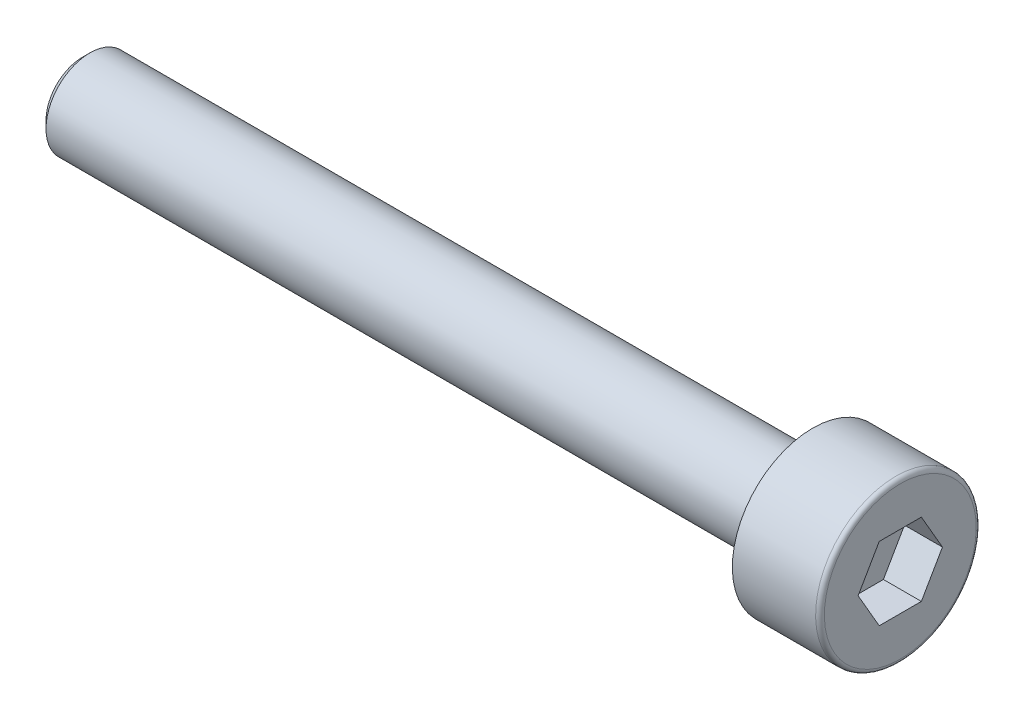
ISO-10303-21;
HEADER;
FILE_DESCRIPTION(('STEP AP214'),'2;1');
FILE_NAME('part.step','',(''),(''),'','','');
FILE_SCHEMA(('AUTOMOTIVE_DESIGN { 1 0 10303 214 1 1 1 1 }'));
ENDSEC;
DATA;
#1=APPLICATION_CONTEXT('core data for automotive mechanical design processes');
#2=APPLICATION_PROTOCOL_DEFINITION('international standard','automotive_design',2000,#1);
#3=PRODUCT_CONTEXT('',#1,'mechanical');
#4=PRODUCT('Part','Part','',(#3));
#5=PRODUCT_RELATED_PRODUCT_CATEGORY('part','',(#4));
#6=PRODUCT_DEFINITION_FORMATION('','',#4);
#7=PRODUCT_DEFINITION_CONTEXT('part definition',#1,'design');
#8=PRODUCT_DEFINITION('design','',#6,#7);
#9=PRODUCT_DEFINITION_SHAPE('','',#8);
#10=(LENGTH_UNIT() NAMED_UNIT(*) SI_UNIT(.MILLI.,.METRE.));
#11=(NAMED_UNIT(*) PLANE_ANGLE_UNIT() SI_UNIT($,.RADIAN.));
#12=(NAMED_UNIT(*) SI_UNIT($,.STERADIAN.) SOLID_ANGLE_UNIT());
#13=UNCERTAINTY_MEASURE_WITH_UNIT(LENGTH_MEASURE(1.E-05),#10,'distance_accuracy_value','');
#14=(GEOMETRIC_REPRESENTATION_CONTEXT(3) GLOBAL_UNCERTAINTY_ASSIGNED_CONTEXT((#13)) GLOBAL_UNIT_ASSIGNED_CONTEXT((#10,
#11,#12)) REPRESENTATION_CONTEXT('',''));
#15=CARTESIAN_POINT('',(0.,0.,0.));
#16=DIRECTION('',(0.,0.,1.));
#17=DIRECTION('',(1.,0.,0.));
#18=AXIS2_PLACEMENT_3D('',#15,#16,#17);
#19=CARTESIAN_POINT('',(0.,0.,0.));
#20=DIRECTION('',(1.,0.,0.));
#21=DIRECTION('',(0.,1.,0.));
#22=AXIS2_PLACEMENT_3D('',#19,#20,#21);
#23=PLANE('',#22);
#24=DIRECTION('',(0.,-0.866025403784439,0.5));
#25=VECTOR('',#24,1.);
#26=CARTESIAN_POINT('',(0.,1.25,0.721687836487035));
#27=LINE('',#26,#25);
#28=CARTESIAN_POINT('',(0.,1.25,0.721687836487035));
#29=VERTEX_POINT('',#28);
#30=CARTESIAN_POINT('',(0.,0.,1.44337567297407));
#31=VERTEX_POINT('',#30);
#32=EDGE_CURVE('E31',#29,#31,#27,.T.);
#33=ORIENTED_EDGE('',*,*,#32,.F.);
#34=DIRECTION('',(0.,0.,1.));
#35=VECTOR('',#34,1.);
#36=CARTESIAN_POINT('',(0.,1.25,-0.721687836487035));
#37=LINE('',#36,#35);
#38=CARTESIAN_POINT('',(0.,1.25,-0.721687836487035));
#39=VERTEX_POINT('',#38);
#40=EDGE_CURVE('E114',#39,#29,#37,.T.);
#41=ORIENTED_EDGE('',*,*,#40,.F.);
#42=DIRECTION('',(0.,0.866025403784439,0.5));
#43=VECTOR('',#42,1.);
#44=CARTESIAN_POINT('',(0.,0.,-1.44337567297406));
#45=LINE('',#44,#43);
#46=CARTESIAN_POINT('',(0.,0.,-1.44337567297406));
#47=VERTEX_POINT('',#46);
#48=EDGE_CURVE('E112',#47,#39,#45,.T.);
#49=ORIENTED_EDGE('',*,*,#48,.F.);
#50=DIRECTION('',(0.,0.866025403784439,-0.5));
#51=VECTOR('',#50,1.);
#52=CARTESIAN_POINT('',(0.,-1.25,-0.721687836487029));
#53=LINE('',#52,#51);
#54=CARTESIAN_POINT('',(0.,-1.25,-0.721687836487029));
#55=VERTEX_POINT('',#54);
#56=EDGE_CURVE('E79',#55,#47,#53,.T.);
#57=ORIENTED_EDGE('',*,*,#56,.F.);
#58=DIRECTION('',(0.,0.,-1.));
#59=VECTOR('',#58,1.);
#60=CARTESIAN_POINT('',(0.,-1.25,0.721687836487035));
#61=LINE('',#60,#59);
#62=CARTESIAN_POINT('',(0.,-1.25,0.721687836487035));
#63=VERTEX_POINT('',#62);
#64=EDGE_CURVE('E108',#63,#55,#61,.T.);
#65=ORIENTED_EDGE('',*,*,#64,.F.);
#66=DIRECTION('',(0.,-0.866025403784439,-0.5));
#67=VECTOR('',#66,1.);
#68=CARTESIAN_POINT('',(0.,0.,1.44337567297407));
#69=LINE('',#68,#67);
#70=EDGE_CURVE('E105',#31,#63,#69,.T.);
#71=ORIENTED_EDGE('',*,*,#70,.F.);
#72=EDGE_LOOP('',(#33,#41,#49,#57,#65,#71));
#73=FACE_BOUND('',#72,.T.);
#74=CARTESIAN_POINT('',(0.,0.,0.));
#75=DIRECTION('',(1.,0.,0.));
#76=DIRECTION('',(0.,1.,0.));
#77=AXIS2_PLACEMENT_3D('',#74,#75,#76);
#78=CIRCLE('',#77,2.6);
#79=CARTESIAN_POINT('',(0.,2.6,0.));
#80=VERTEX_POINT('',#79);
#81=EDGE_CURVE('E132',#80,#80,#78,.T.);
#82=ORIENTED_EDGE('',*,*,#81,.T.);
#83=EDGE_LOOP('',(#82));
#84=FACE_BOUND('',#83,.T.);
#85=ADVANCED_FACE('F16',(#73,#84),#23,.T.);
#86=CARTESIAN_POINT('',(-0.15,0.,0.));
#87=DIRECTION('',(1.,0.,0.));
#88=DIRECTION('',(0.,1.,0.));
#89=AXIS2_PLACEMENT_3D('',#86,#87,#88);
#90=TOROIDAL_SURFACE('',#89,2.6,0.15);
#91=CARTESIAN_POINT('',(-0.15,0.,0.));
#92=DIRECTION('',(1.,0.,0.));
#93=DIRECTION('',(0.,1.,0.));
#94=AXIS2_PLACEMENT_3D('',#91,#92,#93);
#95=CIRCLE('',#94,2.75);
#96=CARTESIAN_POINT('',(-0.15,2.75,0.));
#97=VERTEX_POINT('',#96);
#98=EDGE_CURVE('E129',#97,#97,#95,.T.);
#99=ORIENTED_EDGE('',*,*,#98,.T.);
#100=EDGE_LOOP('',(#99));
#101=FACE_BOUND('',#100,.T.);
#102=ORIENTED_EDGE('',*,*,#81,.F.);
#103=EDGE_LOOP('',(#102));
#104=FACE_BOUND('',#103,.T.);
#105=ADVANCED_FACE('F151',(#101,#104),#90,.T.);
#106=CARTESIAN_POINT('',(0.,0.,0.));
#107=DIRECTION('',(1.,0.,0.));
#108=DIRECTION('',(0.,1.,0.));
#109=AXIS2_PLACEMENT_3D('',#106,#107,#108);
#110=CYLINDRICAL_SURFACE('',#109,2.75);
#111=CARTESIAN_POINT('',(-3.,0.,0.));
#112=DIRECTION('',(1.,0.,0.));
#113=DIRECTION('',(0.,1.,0.));
#114=AXIS2_PLACEMENT_3D('',#111,#112,#113);
#115=CIRCLE('',#114,2.75);
#116=CARTESIAN_POINT('',(-3.,2.75,0.));
#117=VERTEX_POINT('',#116);
#118=EDGE_CURVE('E126',#117,#117,#115,.T.);
#119=ORIENTED_EDGE('',*,*,#118,.T.);
#120=EDGE_LOOP('',(#119));
#121=FACE_BOUND('',#120,.T.);
#122=ORIENTED_EDGE('',*,*,#98,.F.);
#123=EDGE_LOOP('',(#122));
#124=FACE_BOUND('',#123,.T.);
#125=ADVANCED_FACE('F157',(#121,#124),#110,.T.);
#126=CARTESIAN_POINT('',(-3.,2.75,0.));
#127=DIRECTION('',(-1.,0.,0.));
#128=DIRECTION('',(0.,-1.,0.));
#129=AXIS2_PLACEMENT_3D('',#126,#127,#128);
#130=PLANE('',#129);
#131=CARTESIAN_POINT('',(-3.,0.,0.));
#132=DIRECTION('',(1.,0.,0.));
#133=DIRECTION('',(0.,1.,0.));
#134=AXIS2_PLACEMENT_3D('',#131,#132,#133);
#135=CIRCLE('',#134,1.5);
#136=CARTESIAN_POINT('',(-3.,1.5,0.));
#137=VERTEX_POINT('',#136);
#138=EDGE_CURVE('E118',#137,#137,#135,.T.);
#139=ORIENTED_EDGE('',*,*,#138,.T.);
#140=EDGE_LOOP('',(#139));
#141=FACE_BOUND('',#140,.T.);
#142=ORIENTED_EDGE('',*,*,#118,.F.);
#143=EDGE_LOOP('',(#142));
#144=FACE_BOUND('',#143,.T.);
#145=ADVANCED_FACE('F164',(#141,#144),#130,.T.);
#146=CARTESIAN_POINT('',(0.,0.,0.));
#147=DIRECTION('',(1.,0.,0.));
#148=DIRECTION('',(0.,1.,0.));
#149=AXIS2_PLACEMENT_3D('',#146,#147,#148);
#150=CYLINDRICAL_SURFACE('',#149,1.5);
#151=CARTESIAN_POINT('',(-27.75,0.,0.));
#152=DIRECTION('',(-1.,0.,0.));
#153=DIRECTION('',(0.,-1.,0.));
#154=AXIS2_PLACEMENT_3D('',#151,#152,#153);
#155=CIRCLE('',#154,1.5);
#156=CARTESIAN_POINT('',(-27.75,-1.5,0.));
#157=VERTEX_POINT('',#156);
#158=EDGE_CURVE('E24',#157,#157,#155,.F.);
#159=ORIENTED_EDGE('',*,*,#158,.T.);
#160=EDGE_LOOP('',(#159));
#161=FACE_BOUND('',#160,.T.);
#162=ORIENTED_EDGE('',*,*,#138,.F.);
#163=EDGE_LOOP('',(#162));
#164=FACE_BOUND('',#163,.T.);
#165=ADVANCED_FACE('F137',(#161,#164),#150,.T.);
#166=CARTESIAN_POINT('',(-28.,1.5,0.));
#167=DIRECTION('',(-1.,0.,0.));
#168=DIRECTION('',(0.,-1.,0.));
#169=AXIS2_PLACEMENT_3D('',#166,#167,#168);
#170=PLANE('',#169);
#171=CARTESIAN_POINT('',(-28.,0.,0.));
#172=DIRECTION('',(-1.,0.,0.));
#173=DIRECTION('',(0.,-1.,0.));
#174=AXIS2_PLACEMENT_3D('',#171,#172,#173);
#175=CIRCLE('',#174,1.25);
#176=CARTESIAN_POINT('',(-28.,-1.25,0.));
#177=VERTEX_POINT('',#176);
#178=EDGE_CURVE('E11',#177,#177,#175,.T.);
#179=ORIENTED_EDGE('',*,*,#178,.T.);
#180=EDGE_LOOP('',(#179));
#181=FACE_BOUND('',#180,.T.);
#182=ADVANCED_FACE('F171',(#181),#170,.T.);
#183=CARTESIAN_POINT('',(-1.3,1.25,0.721687836487035));
#184=DIRECTION('',(0.,0.5,0.866025403784439));
#185=DIRECTION('',(0.,-0.866025403784439,0.5));
#186=AXIS2_PLACEMENT_3D('',#183,#184,#185);
#187=PLANE('',#186);
#188=ORIENTED_EDGE('',*,*,#32,.T.);
#189=DIRECTION('',(1.,0.,0.));
#190=VECTOR('',#189,1.);
#191=CARTESIAN_POINT('',(-1.3,0.,1.44337567297407));
#192=LINE('',#191,#190);
#193=CARTESIAN_POINT('',(-1.3,0.,1.44337567297407));
#194=VERTEX_POINT('',#193);
#195=EDGE_CURVE('E61',#194,#31,#192,.T.);
#196=ORIENTED_EDGE('',*,*,#195,.F.);
#197=DIRECTION('',(0.,-0.866025403784439,0.5));
#198=VECTOR('',#197,1.);
#199=CARTESIAN_POINT('',(-1.3,1.25,0.721687836487035));
#200=LINE('',#199,#198);
#201=CARTESIAN_POINT('',(-1.3,1.25,0.721687836487035));
#202=VERTEX_POINT('',#201);
#203=EDGE_CURVE('E116',#202,#194,#200,.T.);
#204=ORIENTED_EDGE('',*,*,#203,.F.);
#205=DIRECTION('',(1.,0.,0.));
#206=VECTOR('',#205,1.);
#207=CARTESIAN_POINT('',(-1.3,1.25,0.721687836487035));
#208=LINE('',#207,#206);
#209=EDGE_CURVE('E39',#202,#29,#208,.T.);
#210=ORIENTED_EDGE('',*,*,#209,.T.);
#211=EDGE_LOOP('',(#188,#196,#204,#210));
#212=FACE_BOUND('',#211,.T.);
#213=ADVANCED_FACE('F174',(#212),#187,.F.);
#214=CARTESIAN_POINT('',(-1.3,1.25,-0.721687836487035));
#215=DIRECTION('',(0.,1.,0.));
#216=DIRECTION('',(-1.,0.,0.));
#217=AXIS2_PLACEMENT_3D('',#214,#215,#216);
#218=PLANE('',#217);
#219=ORIENTED_EDGE('',*,*,#40,.T.);
#220=ORIENTED_EDGE('',*,*,#209,.F.);
#221=DIRECTION('',(0.,0.,1.));
#222=VECTOR('',#221,1.);
#223=CARTESIAN_POINT('',(-1.3,1.25,-0.721687836487035));
#224=LINE('',#223,#222);
#225=CARTESIAN_POINT('',(-1.3,1.25,-0.721687836487035));
#226=VERTEX_POINT('',#225);
#227=EDGE_CURVE('E91',#226,#202,#224,.T.);
#228=ORIENTED_EDGE('',*,*,#227,.F.);
#229=DIRECTION('',(1.,0.,0.));
#230=VECTOR('',#229,1.);
#231=CARTESIAN_POINT('',(-1.3,1.25,-0.721687836487035));
#232=LINE('',#231,#230);
#233=EDGE_CURVE('E83',#226,#39,#232,.T.);
#234=ORIENTED_EDGE('',*,*,#233,.T.);
#235=EDGE_LOOP('',(#219,#220,#228,#234));
#236=FACE_BOUND('',#235,.T.);
#237=ADVANCED_FACE('F178',(#236),#218,.F.);
#238=CARTESIAN_POINT('',(-1.3,0.,-1.44337567297406));
#239=DIRECTION('',(0.,0.5,-0.866025403784439));
#240=DIRECTION('',(0.,0.866025403784439,0.5));
#241=AXIS2_PLACEMENT_3D('',#238,#239,#240);
#242=PLANE('',#241);
#243=ORIENTED_EDGE('',*,*,#48,.T.);
#244=ORIENTED_EDGE('',*,*,#233,.F.);
#245=DIRECTION('',(0.,0.866025403784439,0.5));
#246=VECTOR('',#245,1.);
#247=CARTESIAN_POINT('',(-1.3,0.,-1.44337567297406));
#248=LINE('',#247,#246);
#249=CARTESIAN_POINT('',(-1.3,0.,-1.44337567297406));
#250=VERTEX_POINT('',#249);
#251=EDGE_CURVE('E87',#250,#226,#248,.T.);
#252=ORIENTED_EDGE('',*,*,#251,.F.);
#253=DIRECTION('',(1.,0.,0.));
#254=VECTOR('',#253,1.);
#255=CARTESIAN_POINT('',(-1.3,0.,-1.44337567297406));
#256=LINE('',#255,#254);
#257=EDGE_CURVE('E72',#250,#47,#256,.T.);
#258=ORIENTED_EDGE('',*,*,#257,.T.);
#259=EDGE_LOOP('',(#243,#244,#252,#258));
#260=FACE_BOUND('',#259,.T.);
#261=ADVANCED_FACE('F88',(#260),#242,.F.);
#262=CARTESIAN_POINT('',(-1.3,-1.25,-0.721687836487029));
#263=DIRECTION('',(0.,-0.5,-0.866025403784439));
#264=DIRECTION('',(0.,0.866025403784439,-0.5));
#265=AXIS2_PLACEMENT_3D('',#262,#263,#264);
#266=PLANE('',#265);
#267=ORIENTED_EDGE('',*,*,#56,.T.);
#268=ORIENTED_EDGE('',*,*,#257,.F.);
#269=DIRECTION('',(0.,0.866025403784439,-0.5));
#270=VECTOR('',#269,1.);
#271=CARTESIAN_POINT('',(-1.3,-1.25,-0.721687836487029));
#272=LINE('',#271,#270);
#273=CARTESIAN_POINT('',(-1.3,-1.25,-0.721687836487029));
#274=VERTEX_POINT('',#273);
#275=EDGE_CURVE('E76',#274,#250,#272,.T.);
#276=ORIENTED_EDGE('',*,*,#275,.F.);
#277=DIRECTION('',(1.,0.,0.));
#278=VECTOR('',#277,1.);
#279=CARTESIAN_POINT('',(-1.3,-1.25,-0.721687836487029));
#280=LINE('',#279,#278);
#281=EDGE_CURVE('E84',#274,#55,#280,.T.);
#282=ORIENTED_EDGE('',*,*,#281,.T.);
#283=EDGE_LOOP('',(#267,#268,#276,#282));
#284=FACE_BOUND('',#283,.T.);
#285=ADVANCED_FACE('F74',(#284),#266,.F.);
#286=CARTESIAN_POINT('',(-1.3,-1.25,0.721687836487035));
#287=DIRECTION('',(0.,-1.,0.));
#288=DIRECTION('',(0.,0.,-1.));
#289=AXIS2_PLACEMENT_3D('',#286,#287,#288);
#290=PLANE('',#289);
#291=ORIENTED_EDGE('',*,*,#64,.T.);
#292=ORIENTED_EDGE('',*,*,#281,.F.);
#293=DIRECTION('',(0.,0.,-1.));
#294=VECTOR('',#293,1.);
#295=CARTESIAN_POINT('',(-1.3,-1.25,0.721687836487035));
#296=LINE('',#295,#294);
#297=CARTESIAN_POINT('',(-1.3,-1.25,0.721687836487035));
#298=VERTEX_POINT('',#297);
#299=EDGE_CURVE('E97',#298,#274,#296,.T.);
#300=ORIENTED_EDGE('',*,*,#299,.F.);
#301=DIRECTION('',(1.,0.,0.));
#302=VECTOR('',#301,1.);
#303=CARTESIAN_POINT('',(-1.3,-1.25,0.721687836487035));
#304=LINE('',#303,#302);
#305=EDGE_CURVE('E121',#298,#63,#304,.T.);
#306=ORIENTED_EDGE('',*,*,#305,.T.);
#307=EDGE_LOOP('',(#291,#292,#300,#306));
#308=FACE_BOUND('',#307,.T.);
#309=ADVANCED_FACE('F181',(#308),#290,.F.);
#310=CARTESIAN_POINT('',(-1.3,0.,1.44337567297407));
#311=DIRECTION('',(0.,-0.5,0.866025403784439));
#312=DIRECTION('',(0.,-0.866025403784439,-0.5));
#313=AXIS2_PLACEMENT_3D('',#310,#311,#312);
#314=PLANE('',#313);
#315=ORIENTED_EDGE('',*,*,#70,.T.);
#316=ORIENTED_EDGE('',*,*,#305,.F.);
#317=DIRECTION('',(0.,-0.866025403784439,-0.5));
#318=VECTOR('',#317,1.);
#319=CARTESIAN_POINT('',(-1.3,0.,1.44337567297407));
#320=LINE('',#319,#318);
#321=EDGE_CURVE('E99',#194,#298,#320,.T.);
#322=ORIENTED_EDGE('',*,*,#321,.F.);
#323=ORIENTED_EDGE('',*,*,#195,.T.);
#324=EDGE_LOOP('',(#315,#316,#322,#323));
#325=FACE_BOUND('',#324,.T.);
#326=ADVANCED_FACE('F147',(#325),#314,.F.);
#327=CARTESIAN_POINT('',(-1.3,0.,1.44337567297407));
#328=DIRECTION('',(1.,0.,0.));
#329=DIRECTION('',(0.,1.,0.));
#330=AXIS2_PLACEMENT_3D('',#327,#328,#329);
#331=PLANE('',#330);
#332=ORIENTED_EDGE('',*,*,#203,.T.);
#333=ORIENTED_EDGE('',*,*,#321,.T.);
#334=ORIENTED_EDGE('',*,*,#299,.T.);
#335=ORIENTED_EDGE('',*,*,#275,.T.);
#336=ORIENTED_EDGE('',*,*,#251,.T.);
#337=ORIENTED_EDGE('',*,*,#227,.T.);
#338=EDGE_LOOP('',(#332,#333,#334,#335,#336,#337));
#339=FACE_BOUND('',#338,.T.);
#340=ADVANCED_FACE('F94',(#339),#331,.T.);
#341=CARTESIAN_POINT('',(-27.75,0.,0.));
#342=DIRECTION('',(1.,0.,0.));
#343=DIRECTION('',(0.,1.,0.));
#344=AXIS2_PLACEMENT_3D('',#341,#342,#343);
#345=CONICAL_SURFACE('',#344,1.5,0.785398163397445);
#346=ORIENTED_EDGE('',*,*,#178,.F.);
#347=EDGE_LOOP('',(#346));
#348=FACE_BOUND('',#347,.T.);
#349=ORIENTED_EDGE('',*,*,#158,.F.);
#350=EDGE_LOOP('',(#349));
#351=FACE_BOUND('',#350,.T.);
#352=ADVANCED_FACE('F18',(#348,#351),#345,.T.);
#353=CLOSED_SHELL('',(#85,#105,#125,#145,#165,#182,#213,#237,#261,#285,#309,#326,#340,#352));
#354=MANIFOLD_SOLID_BREP('B1',#353);
#355=ADVANCED_BREP_SHAPE_REPRESENTATION('',(#18,#354),#14);
#356=SHAPE_DEFINITION_REPRESENTATION(#9,#355);
ENDSEC;
END-ISO-10303-21;
